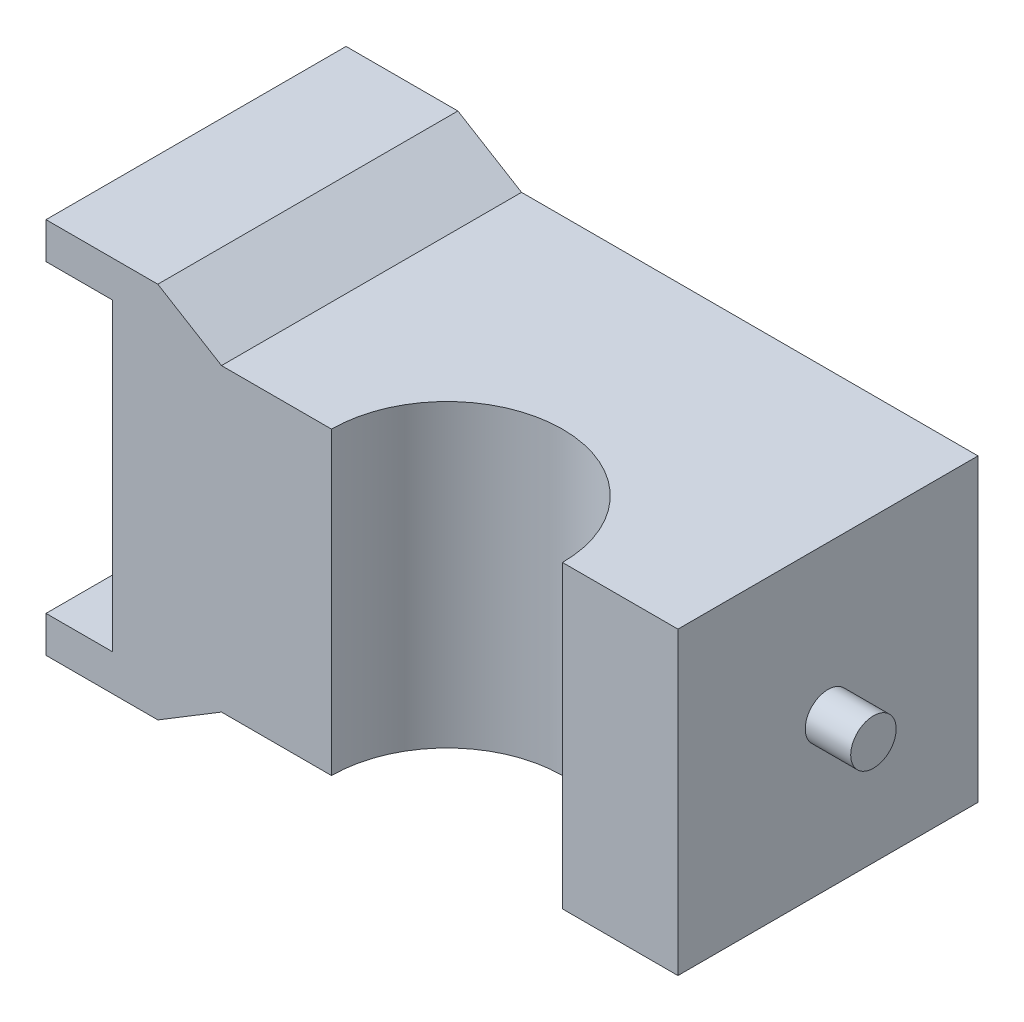
ISO-10303-21;
HEADER;
FILE_DESCRIPTION(('STEP AP214'),'2;1');
FILE_NAME('part.step','',(''),(''),'','','');
FILE_SCHEMA(('AUTOMOTIVE_DESIGN { 1 0 10303 214 1 1 1 1 }'));
ENDSEC;
DATA;
#1=APPLICATION_CONTEXT('core data for automotive mechanical design processes');
#2=APPLICATION_PROTOCOL_DEFINITION('international standard','automotive_design',2000,#1);
#3=PRODUCT_CONTEXT('',#1,'mechanical');
#4=PRODUCT('Part','Part','',(#3));
#5=PRODUCT_RELATED_PRODUCT_CATEGORY('part','',(#4));
#6=PRODUCT_DEFINITION_FORMATION('','',#4);
#7=PRODUCT_DEFINITION_CONTEXT('part definition',#1,'design');
#8=PRODUCT_DEFINITION('design','',#6,#7);
#9=PRODUCT_DEFINITION_SHAPE('','',#8);
#10=(LENGTH_UNIT() NAMED_UNIT(*) SI_UNIT(.MILLI.,.METRE.));
#11=(NAMED_UNIT(*) PLANE_ANGLE_UNIT() SI_UNIT($,.RADIAN.));
#12=(NAMED_UNIT(*) SI_UNIT($,.STERADIAN.) SOLID_ANGLE_UNIT());
#13=UNCERTAINTY_MEASURE_WITH_UNIT(LENGTH_MEASURE(1.E-05),#10,'distance_accuracy_value','');
#14=(GEOMETRIC_REPRESENTATION_CONTEXT(3) GLOBAL_UNCERTAINTY_ASSIGNED_CONTEXT((#13)) GLOBAL_UNIT_ASSIGNED_CONTEXT((#10,
#11,#12)) REPRESENTATION_CONTEXT('',''));
#15=CARTESIAN_POINT('',(0.,0.,0.));
#16=DIRECTION('',(0.,0.,1.));
#17=DIRECTION('',(1.,0.,0.));
#18=AXIS2_PLACEMENT_3D('',#15,#16,#17);
#19=CARTESIAN_POINT('',(0.,0.,16.5));
#20=DIRECTION('',(0.,0.,-1.));
#21=DIRECTION('',(-1.,0.,0.));
#22=AXIS2_PLACEMENT_3D('',#19,#20,#21);
#23=PLANE('',#22);
#24=DIRECTION('',(0.,-1.,0.));
#25=VECTOR('',#24,1.);
#26=CARTESIAN_POINT('',(12.4,20.75,16.5));
#27=LINE('',#26,#25);
#28=CARTESIAN_POINT('',(12.4,-16.5,16.5));
#29=VERTEX_POINT('',#28);
#30=CARTESIAN_POINT('',(12.4,16.5,16.5));
#31=VERTEX_POINT('',#30);
#32=EDGE_CURVE('E11',#29,#31,#27,.F.);
#33=ORIENTED_EDGE('',*,*,#32,.F.);
#34=DIRECTION('',(1.,0.,0.));
#35=VECTOR('',#34,1.);
#36=CARTESIAN_POINT('',(25.1,-16.5,16.5));
#37=LINE('',#36,#35);
#38=CARTESIAN_POINT('',(25.1,-16.5,16.5));
#39=VERTEX_POINT('',#38);
#40=EDGE_CURVE('E59',#29,#39,#37,.T.);
#41=ORIENTED_EDGE('',*,*,#40,.T.);
#42=DIRECTION('',(0.,1.,0.));
#43=VECTOR('',#42,1.);
#44=CARTESIAN_POINT('',(25.1,16.5,16.5));
#45=LINE('',#44,#43);
#46=CARTESIAN_POINT('',(25.1,16.5,16.5));
#47=VERTEX_POINT('',#46);
#48=EDGE_CURVE('E197',#39,#47,#45,.T.);
#49=ORIENTED_EDGE('',*,*,#48,.T.);
#50=DIRECTION('',(-1.,0.,0.));
#51=VECTOR('',#50,1.);
#52=CARTESIAN_POINT('',(25.1,16.5,16.5));
#53=LINE('',#52,#51);
#54=EDGE_CURVE('E113',#47,#31,#53,.T.);
#55=ORIENTED_EDGE('',*,*,#54,.T.);
#56=EDGE_LOOP('',(#33,#41,#49,#55));
#57=FACE_BOUND('',#56,.T.);
#58=ADVANCED_FACE('F36',(#57),#23,.F.);
#59=DIRECTION('',(0.,-1.,0.));
#60=VECTOR('',#59,1.);
#61=CARTESIAN_POINT('',(-13.,20.75,16.5));
#62=LINE('',#61,#60);
#63=CARTESIAN_POINT('',(-13.,16.5000000000001,16.5));
#64=VERTEX_POINT('',#63);
#65=CARTESIAN_POINT('',(-13.,-16.5,16.5));
#66=VERTEX_POINT('',#65);
#67=EDGE_CURVE('E44',#64,#66,#62,.T.);
#68=ORIENTED_EDGE('',*,*,#67,.F.);
#69=CARTESIAN_POINT('',(-25.1,16.5,16.5));
#70=VERTEX_POINT('',#69);
#71=EDGE_CURVE('E247',#64,#70,#53,.T.);
#72=ORIENTED_EDGE('',*,*,#71,.T.);
#73=DIRECTION('',(-0.854787515221729,0.518978134241763,0.));
#74=VECTOR('',#73,1.);
#75=CARTESIAN_POINT('',(-32.1,20.75,16.5));
#76=LINE('',#75,#74);
#77=CARTESIAN_POINT('',(-32.1,20.75,16.5));
#78=VERTEX_POINT('',#77);
#79=EDGE_CURVE('E249',#70,#78,#76,.T.);
#80=ORIENTED_EDGE('',*,*,#79,.T.);
#81=DIRECTION('',(-1.,0.,0.));
#82=VECTOR('',#81,1.);
#83=CARTESIAN_POINT('',(-44.4,20.75,16.5));
#84=LINE('',#83,#82);
#85=CARTESIAN_POINT('',(-44.4,20.75,16.5));
#86=VERTEX_POINT('',#85);
#87=EDGE_CURVE('E251',#78,#86,#84,.T.);
#88=ORIENTED_EDGE('',*,*,#87,.T.);
#89=DIRECTION('',(0.,-1.,0.));
#90=VECTOR('',#89,1.);
#91=CARTESIAN_POINT('',(-44.4,20.75,16.5));
#92=LINE('',#91,#90);
#93=CARTESIAN_POINT('',(-44.4,16.75,16.5));
#94=VERTEX_POINT('',#93);
#95=EDGE_CURVE('E253',#86,#94,#92,.T.);
#96=ORIENTED_EDGE('',*,*,#95,.T.);
#97=DIRECTION('',(1.,0.,0.));
#98=VECTOR('',#97,1.);
#99=CARTESIAN_POINT('',(-44.4,16.75,16.5));
#100=LINE('',#99,#98);
#101=CARTESIAN_POINT('',(-37.1,16.75,16.5));
#102=VERTEX_POINT('',#101);
#103=EDGE_CURVE('E255',#94,#102,#100,.T.);
#104=ORIENTED_EDGE('',*,*,#103,.T.);
#105=DIRECTION('',(0.,-1.,0.));
#106=VECTOR('',#105,1.);
#107=CARTESIAN_POINT('',(-37.1,16.75,16.5));
#108=LINE('',#107,#106);
#109=CARTESIAN_POINT('',(-37.1,-16.75,16.5));
#110=VERTEX_POINT('',#109);
#111=EDGE_CURVE('E257',#102,#110,#108,.T.);
#112=ORIENTED_EDGE('',*,*,#111,.T.);
#113=DIRECTION('',(-1.,0.,0.));
#114=VECTOR('',#113,1.);
#115=CARTESIAN_POINT('',(-44.4,-16.75,16.5));
#116=LINE('',#115,#114);
#117=CARTESIAN_POINT('',(-44.4,-16.75,16.5));
#118=VERTEX_POINT('',#117);
#119=EDGE_CURVE('E259',#110,#118,#116,.T.);
#120=ORIENTED_EDGE('',*,*,#119,.T.);
#121=DIRECTION('',(0.,-1.,0.));
#122=VECTOR('',#121,1.);
#123=CARTESIAN_POINT('',(-44.4,-20.75,16.5));
#124=LINE('',#123,#122);
#125=CARTESIAN_POINT('',(-44.4,-20.75,16.5));
#126=VERTEX_POINT('',#125);
#127=EDGE_CURVE('E150',#118,#126,#124,.T.);
#128=ORIENTED_EDGE('',*,*,#127,.T.);
#129=DIRECTION('',(1.,0.,0.));
#130=VECTOR('',#129,1.);
#131=CARTESIAN_POINT('',(-44.4,-20.75,16.5));
#132=LINE('',#131,#130);
#133=CARTESIAN_POINT('',(-32.1,-20.75,16.5));
#134=VERTEX_POINT('',#133);
#135=EDGE_CURVE('E142',#126,#134,#132,.T.);
#136=ORIENTED_EDGE('',*,*,#135,.T.);
#137=DIRECTION('',(0.85478751522173,0.518978134241763,0.));
#138=VECTOR('',#137,1.);
#139=CARTESIAN_POINT('',(-32.1,-20.75,16.5));
#140=LINE('',#139,#138);
#141=CARTESIAN_POINT('',(-25.1,-16.5,16.5));
#142=VERTEX_POINT('',#141);
#143=EDGE_CURVE('E147',#134,#142,#140,.T.);
#144=ORIENTED_EDGE('',*,*,#143,.T.);
#145=EDGE_CURVE('E168',#142,#66,#37,.T.);
#146=ORIENTED_EDGE('',*,*,#145,.T.);
#147=EDGE_LOOP('',(#68,#72,#80,#88,#96,#104,#112,#120,#128,#136,#144,#146));
#148=FACE_BOUND('',#147,.T.);
#149=ADVANCED_FACE('F144',(#148),#23,.F.);
#150=CARTESIAN_POINT('',(25.1,16.5,16.5));
#151=DIRECTION('',(-1.,0.,0.));
#152=DIRECTION('',(0.,-1.,0.));
#153=AXIS2_PLACEMENT_3D('',#150,#151,#152);
#154=PLANE('',#153);
#155=DIRECTION('',(0.,1.,0.));
#156=VECTOR('',#155,1.);
#157=CARTESIAN_POINT('',(25.1,16.5,-16.5));
#158=LINE('',#157,#156);
#159=CARTESIAN_POINT('',(25.1,-16.5,-16.5));
#160=VERTEX_POINT('',#159);
#161=CARTESIAN_POINT('',(25.1,16.5,-16.5));
#162=VERTEX_POINT('',#161);
#163=EDGE_CURVE('E173',#160,#162,#158,.T.);
#164=ORIENTED_EDGE('',*,*,#163,.T.);
#165=DIRECTION('',(0.,0.,-1.));
#166=VECTOR('',#165,1.);
#167=CARTESIAN_POINT('',(25.1,16.5,16.5));
#168=LINE('',#167,#166);
#169=EDGE_CURVE('E222',#47,#162,#168,.T.);
#170=ORIENTED_EDGE('',*,*,#169,.F.);
#171=ORIENTED_EDGE('',*,*,#48,.F.);
#172=DIRECTION('',(0.,0.,-1.));
#173=VECTOR('',#172,1.);
#174=CARTESIAN_POINT('',(25.1,-16.5,16.5));
#175=LINE('',#174,#173);
#176=EDGE_CURVE('E172',#39,#160,#175,.T.);
#177=ORIENTED_EDGE('',*,*,#176,.T.);
#178=EDGE_LOOP('',(#164,#170,#171,#177));
#179=FACE_BOUND('',#178,.T.);
#180=CARTESIAN_POINT('',(25.1,0.,0.));
#181=DIRECTION('',(-1.,0.,0.));
#182=DIRECTION('',(0.,-1.,0.));
#183=AXIS2_PLACEMENT_3D('',#180,#181,#182);
#184=CIRCLE('',#183,2.5);
#185=CARTESIAN_POINT('',(25.1,-2.50000000000001,0.));
#186=VERTEX_POINT('',#185);
#187=EDGE_CURVE('E227',#186,#186,#184,.F.);
#188=ORIENTED_EDGE('',*,*,#187,.F.);
#189=EDGE_LOOP('',(#188));
#190=FACE_BOUND('',#189,.T.);
#191=ADVANCED_FACE('F38',(#179,#190),#154,.F.);
#192=CARTESIAN_POINT('',(-37.1,16.75,16.5));
#193=DIRECTION('',(1.,0.,0.));
#194=DIRECTION('',(0.,1.,0.));
#195=AXIS2_PLACEMENT_3D('',#192,#193,#194);
#196=PLANE('',#195);
#197=DIRECTION('',(0.,-1.,0.));
#198=VECTOR('',#197,1.);
#199=CARTESIAN_POINT('',(-37.1,16.75,-16.5));
#200=LINE('',#199,#198);
#201=CARTESIAN_POINT('',(-37.1,16.75,-16.5));
#202=VERTEX_POINT('',#201);
#203=CARTESIAN_POINT('',(-37.1,-16.75,-16.5));
#204=VERTEX_POINT('',#203);
#205=EDGE_CURVE('E187',#202,#204,#200,.T.);
#206=ORIENTED_EDGE('',*,*,#205,.T.);
#207=DIRECTION('',(0.,0.,-1.));
#208=VECTOR('',#207,1.);
#209=CARTESIAN_POINT('',(-37.1,-16.75,16.5));
#210=LINE('',#209,#208);
#211=EDGE_CURVE('E204',#110,#204,#210,.T.);
#212=ORIENTED_EDGE('',*,*,#211,.F.);
#213=ORIENTED_EDGE('',*,*,#111,.F.);
#214=DIRECTION('',(0.,0.,-1.));
#215=VECTOR('',#214,1.);
#216=CARTESIAN_POINT('',(-37.1,16.75,16.5));
#217=LINE('',#216,#215);
#218=EDGE_CURVE('E207',#102,#202,#217,.T.);
#219=ORIENTED_EDGE('',*,*,#218,.T.);
#220=EDGE_LOOP('',(#206,#212,#213,#219));
#221=FACE_BOUND('',#220,.T.);
#222=CARTESIAN_POINT('',(-37.1,0.,0.));
#223=DIRECTION('',(1.,0.,0.));
#224=DIRECTION('',(0.,1.,0.));
#225=AXIS2_PLACEMENT_3D('',#222,#223,#224);
#226=CIRCLE('',#225,2.5);
#227=CARTESIAN_POINT('',(-37.1,2.49999999999999,0.));
#228=VERTEX_POINT('',#227);
#229=EDGE_CURVE('E224',#228,#228,#226,.F.);
#230=ORIENTED_EDGE('',*,*,#229,.F.);
#231=EDGE_LOOP('',(#230));
#232=FACE_BOUND('',#231,.T.);
#233=ADVANCED_FACE('F301',(#221,#232),#196,.F.);
#234=CARTESIAN_POINT('',(25.1,16.5,16.5));
#235=DIRECTION('',(0.,-1.,0.));
#236=DIRECTION('',(1.,0.,0.));
#237=AXIS2_PLACEMENT_3D('',#234,#235,#236);
#238=PLANE('',#237);
#239=CARTESIAN_POINT('',(-0.299999999999998,16.5,16.5));
#240=DIRECTION('',(0.,-1.,0.));
#241=DIRECTION('',(1.,0.,0.));
#242=AXIS2_PLACEMENT_3D('',#239,#240,#241);
#243=CIRCLE('',#242,12.7);
#244=EDGE_CURVE('E50',#31,#64,#243,.F.);
#245=ORIENTED_EDGE('',*,*,#244,.F.);
#246=ORIENTED_EDGE('',*,*,#54,.F.);
#247=ORIENTED_EDGE('',*,*,#169,.T.);
#248=DIRECTION('',(-1.,0.,0.));
#249=VECTOR('',#248,1.);
#250=CARTESIAN_POINT('',(25.1,16.5,-16.5));
#251=LINE('',#250,#249);
#252=CARTESIAN_POINT('',(-25.1,16.5,-16.5));
#253=VERTEX_POINT('',#252);
#254=EDGE_CURVE('E176',#162,#253,#251,.T.);
#255=ORIENTED_EDGE('',*,*,#254,.T.);
#256=DIRECTION('',(0.,0.,-1.));
#257=VECTOR('',#256,1.);
#258=CARTESIAN_POINT('',(-25.1,16.5,16.5));
#259=LINE('',#258,#257);
#260=EDGE_CURVE('E219',#70,#253,#259,.T.);
#261=ORIENTED_EDGE('',*,*,#260,.F.);
#262=ORIENTED_EDGE('',*,*,#71,.F.);
#263=EDGE_LOOP('',(#245,#246,#247,#255,#261,#262));
#264=FACE_BOUND('',#263,.T.);
#265=ADVANCED_FACE('F278',(#264),#238,.F.);
#266=CARTESIAN_POINT('',(-32.1,20.75,16.5));
#267=DIRECTION('',(-0.518978134241763,-0.854787515221729,0.));
#268=DIRECTION('',(0.85478751522173,-0.518978134241763,0.));
#269=AXIS2_PLACEMENT_3D('',#266,#267,#268);
#270=PLANE('',#269);
#271=DIRECTION('',(-0.854787515221729,0.518978134241763,0.));
#272=VECTOR('',#271,1.);
#273=CARTESIAN_POINT('',(-32.1,20.75,-16.5));
#274=LINE('',#273,#272);
#275=CARTESIAN_POINT('',(-32.1,20.75,-16.5));
#276=VERTEX_POINT('',#275);
#277=EDGE_CURVE('E179',#253,#276,#274,.T.);
#278=ORIENTED_EDGE('',*,*,#277,.T.);
#279=DIRECTION('',(0.,0.,-1.));
#280=VECTOR('',#279,1.);
#281=CARTESIAN_POINT('',(-32.1,20.75,16.5));
#282=LINE('',#281,#280);
#283=EDGE_CURVE('E216',#78,#276,#282,.T.);
#284=ORIENTED_EDGE('',*,*,#283,.F.);
#285=ORIENTED_EDGE('',*,*,#79,.F.);
#286=ORIENTED_EDGE('',*,*,#260,.T.);
#287=EDGE_LOOP('',(#278,#284,#285,#286));
#288=FACE_BOUND('',#287,.T.);
#289=ADVANCED_FACE('F285',(#288),#270,.F.);
#290=CARTESIAN_POINT('',(-44.4,20.75,16.5));
#291=DIRECTION('',(0.,-1.,0.));
#292=DIRECTION('',(1.,0.,0.));
#293=AXIS2_PLACEMENT_3D('',#290,#291,#292);
#294=PLANE('',#293);
#295=DIRECTION('',(-1.,0.,0.));
#296=VECTOR('',#295,1.);
#297=CARTESIAN_POINT('',(-44.4,20.75,-16.5));
#298=LINE('',#297,#296);
#299=CARTESIAN_POINT('',(-44.4,20.75,-16.5));
#300=VERTEX_POINT('',#299);
#301=EDGE_CURVE('E181',#276,#300,#298,.T.);
#302=ORIENTED_EDGE('',*,*,#301,.T.);
#303=DIRECTION('',(0.,0.,-1.));
#304=VECTOR('',#303,1.);
#305=CARTESIAN_POINT('',(-44.4,20.75,16.5));
#306=LINE('',#305,#304);
#307=EDGE_CURVE('E213',#86,#300,#306,.T.);
#308=ORIENTED_EDGE('',*,*,#307,.F.);
#309=ORIENTED_EDGE('',*,*,#87,.F.);
#310=ORIENTED_EDGE('',*,*,#283,.T.);
#311=EDGE_LOOP('',(#302,#308,#309,#310));
#312=FACE_BOUND('',#311,.T.);
#313=ADVANCED_FACE('F288',(#312),#294,.F.);
#314=CARTESIAN_POINT('',(-44.4,20.75,16.5));
#315=DIRECTION('',(1.,0.,0.));
#316=DIRECTION('',(0.,1.,0.));
#317=AXIS2_PLACEMENT_3D('',#314,#315,#316);
#318=PLANE('',#317);
#319=DIRECTION('',(0.,-1.,0.));
#320=VECTOR('',#319,1.);
#321=CARTESIAN_POINT('',(-44.4,20.75,-16.5));
#322=LINE('',#321,#320);
#323=CARTESIAN_POINT('',(-44.4,16.75,-16.5));
#324=VERTEX_POINT('',#323);
#325=EDGE_CURVE('E183',#300,#324,#322,.T.);
#326=ORIENTED_EDGE('',*,*,#325,.T.);
#327=DIRECTION('',(0.,0.,-1.));
#328=VECTOR('',#327,1.);
#329=CARTESIAN_POINT('',(-44.4,16.75,16.5));
#330=LINE('',#329,#328);
#331=EDGE_CURVE('E210',#94,#324,#330,.T.);
#332=ORIENTED_EDGE('',*,*,#331,.F.);
#333=ORIENTED_EDGE('',*,*,#95,.F.);
#334=ORIENTED_EDGE('',*,*,#307,.T.);
#335=EDGE_LOOP('',(#326,#332,#333,#334));
#336=FACE_BOUND('',#335,.T.);
#337=ADVANCED_FACE('F293',(#336),#318,.F.);
#338=CARTESIAN_POINT('',(-44.4,16.75,16.5));
#339=DIRECTION('',(0.,1.,0.));
#340=DIRECTION('',(-1.,0.,0.));
#341=AXIS2_PLACEMENT_3D('',#338,#339,#340);
#342=PLANE('',#341);
#343=DIRECTION('',(1.,0.,0.));
#344=VECTOR('',#343,1.);
#345=CARTESIAN_POINT('',(-44.4,16.75,-16.5));
#346=LINE('',#345,#344);
#347=EDGE_CURVE('E185',#324,#202,#346,.T.);
#348=ORIENTED_EDGE('',*,*,#347,.T.);
#349=ORIENTED_EDGE('',*,*,#218,.F.);
#350=ORIENTED_EDGE('',*,*,#103,.F.);
#351=ORIENTED_EDGE('',*,*,#331,.T.);
#352=EDGE_LOOP('',(#348,#349,#350,#351));
#353=FACE_BOUND('',#352,.T.);
#354=ADVANCED_FACE('F297',(#353),#342,.F.);
#355=CARTESIAN_POINT('',(-44.4,-16.75,16.5));
#356=DIRECTION('',(0.,-1.,0.));
#357=DIRECTION('',(1.,0.,0.));
#358=AXIS2_PLACEMENT_3D('',#355,#356,#357);
#359=PLANE('',#358);
#360=DIRECTION('',(-1.,0.,0.));
#361=VECTOR('',#360,1.);
#362=CARTESIAN_POINT('',(-44.4,-16.75,-16.5));
#363=LINE('',#362,#361);
#364=CARTESIAN_POINT('',(-44.4,-16.75,-16.5));
#365=VERTEX_POINT('',#364);
#366=EDGE_CURVE('E189',#204,#365,#363,.T.);
#367=ORIENTED_EDGE('',*,*,#366,.T.);
#368=DIRECTION('',(0.,0.,-1.));
#369=VECTOR('',#368,1.);
#370=CARTESIAN_POINT('',(-44.4,-16.75,16.5));
#371=LINE('',#370,#369);
#372=EDGE_CURVE('E201',#118,#365,#371,.T.);
#373=ORIENTED_EDGE('',*,*,#372,.F.);
#374=ORIENTED_EDGE('',*,*,#119,.F.);
#375=ORIENTED_EDGE('',*,*,#211,.T.);
#376=EDGE_LOOP('',(#367,#373,#374,#375));
#377=FACE_BOUND('',#376,.T.);
#378=ADVANCED_FACE('F265',(#377),#359,.F.);
#379=CARTESIAN_POINT('',(-44.4,-20.75,16.5));
#380=DIRECTION('',(1.,0.,0.));
#381=DIRECTION('',(0.,1.,0.));
#382=AXIS2_PLACEMENT_3D('',#379,#380,#381);
#383=PLANE('',#382);
#384=DIRECTION('',(0.,-1.,0.));
#385=VECTOR('',#384,1.);
#386=CARTESIAN_POINT('',(-44.4,-20.75,-16.5));
#387=LINE('',#386,#385);
#388=CARTESIAN_POINT('',(-44.4,-20.75,-16.5));
#389=VERTEX_POINT('',#388);
#390=EDGE_CURVE('E191',#365,#389,#387,.T.);
#391=ORIENTED_EDGE('',*,*,#390,.T.);
#392=DIRECTION('',(0.,0.,-1.));
#393=VECTOR('',#392,1.);
#394=CARTESIAN_POINT('',(-44.4,-20.75,16.5));
#395=LINE('',#394,#393);
#396=EDGE_CURVE('E162',#126,#389,#395,.T.);
#397=ORIENTED_EDGE('',*,*,#396,.F.);
#398=ORIENTED_EDGE('',*,*,#127,.F.);
#399=ORIENTED_EDGE('',*,*,#372,.T.);
#400=EDGE_LOOP('',(#391,#397,#398,#399));
#401=FACE_BOUND('',#400,.T.);
#402=ADVANCED_FACE('F269',(#401),#383,.F.);
#403=CARTESIAN_POINT('',(-44.4,-20.75,16.5));
#404=DIRECTION('',(0.,1.,0.));
#405=DIRECTION('',(-1.,0.,0.));
#406=AXIS2_PLACEMENT_3D('',#403,#404,#405);
#407=PLANE('',#406);
#408=DIRECTION('',(1.,0.,0.));
#409=VECTOR('',#408,1.);
#410=CARTESIAN_POINT('',(-44.4,-20.75,-16.5));
#411=LINE('',#410,#409);
#412=CARTESIAN_POINT('',(-32.1,-20.75,-16.5));
#413=VERTEX_POINT('',#412);
#414=EDGE_CURVE('E159',#389,#413,#411,.T.);
#415=ORIENTED_EDGE('',*,*,#414,.T.);
#416=DIRECTION('',(0.,0.,-1.));
#417=VECTOR('',#416,1.);
#418=CARTESIAN_POINT('',(-32.1,-20.75,16.5));
#419=LINE('',#418,#417);
#420=EDGE_CURVE('E156',#134,#413,#419,.T.);
#421=ORIENTED_EDGE('',*,*,#420,.F.);
#422=ORIENTED_EDGE('',*,*,#135,.F.);
#423=ORIENTED_EDGE('',*,*,#396,.T.);
#424=EDGE_LOOP('',(#415,#421,#422,#423));
#425=FACE_BOUND('',#424,.T.);
#426=ADVANCED_FACE('F157',(#425),#407,.F.);
#427=CARTESIAN_POINT('',(-32.1,-20.75,16.5));
#428=DIRECTION('',(-0.518978134241763,0.854787515221729,0.));
#429=DIRECTION('',(-0.85478751522173,-0.518978134241763,0.));
#430=AXIS2_PLACEMENT_3D('',#427,#428,#429);
#431=PLANE('',#430);
#432=DIRECTION('',(0.85478751522173,0.518978134241763,0.));
#433=VECTOR('',#432,1.);
#434=CARTESIAN_POINT('',(-32.1,-20.75,-16.5));
#435=LINE('',#434,#433);
#436=CARTESIAN_POINT('',(-25.1,-16.5,-16.5));
#437=VERTEX_POINT('',#436);
#438=EDGE_CURVE('E194',#413,#437,#435,.T.);
#439=ORIENTED_EDGE('',*,*,#438,.T.);
#440=DIRECTION('',(0.,0.,-1.));
#441=VECTOR('',#440,1.);
#442=CARTESIAN_POINT('',(-25.1,-16.5,16.5));
#443=LINE('',#442,#441);
#444=EDGE_CURVE('E163',#142,#437,#443,.T.);
#445=ORIENTED_EDGE('',*,*,#444,.F.);
#446=ORIENTED_EDGE('',*,*,#143,.F.);
#447=ORIENTED_EDGE('',*,*,#420,.T.);
#448=EDGE_LOOP('',(#439,#445,#446,#447));
#449=FACE_BOUND('',#448,.T.);
#450=ADVANCED_FACE('F165',(#449),#431,.F.);
#451=CARTESIAN_POINT('',(25.1,-16.5,16.5));
#452=DIRECTION('',(0.,1.,0.));
#453=DIRECTION('',(0.,0.,1.));
#454=AXIS2_PLACEMENT_3D('',#451,#452,#453);
#455=PLANE('',#454);
#456=CARTESIAN_POINT('',(-0.299999999999998,-16.5,16.5));
#457=DIRECTION('',(0.,1.,0.));
#458=DIRECTION('',(0.,0.,1.));
#459=AXIS2_PLACEMENT_3D('',#456,#457,#458);
#460=CIRCLE('',#459,12.7);
#461=EDGE_CURVE('E234',#66,#29,#460,.F.);
#462=ORIENTED_EDGE('',*,*,#461,.F.);
#463=ORIENTED_EDGE('',*,*,#145,.F.);
#464=ORIENTED_EDGE('',*,*,#444,.T.);
#465=DIRECTION('',(1.,0.,0.));
#466=VECTOR('',#465,1.);
#467=CARTESIAN_POINT('',(25.1,-16.5,-16.5));
#468=LINE('',#467,#466);
#469=EDGE_CURVE('E105',#437,#160,#468,.T.);
#470=ORIENTED_EDGE('',*,*,#469,.T.);
#471=ORIENTED_EDGE('',*,*,#176,.F.);
#472=ORIENTED_EDGE('',*,*,#40,.F.);
#473=EDGE_LOOP('',(#462,#463,#464,#470,#471,#472));
#474=FACE_BOUND('',#473,.T.);
#475=ADVANCED_FACE('F237',(#474),#455,.F.);
#476=CARTESIAN_POINT('',(0.,0.,-16.5));
#477=DIRECTION('',(0.,0.,-1.));
#478=DIRECTION('',(-1.,0.,0.));
#479=AXIS2_PLACEMENT_3D('',#476,#477,#478);
#480=PLANE('',#479);
#481=ORIENTED_EDGE('',*,*,#163,.F.);
#482=ORIENTED_EDGE('',*,*,#469,.F.);
#483=ORIENTED_EDGE('',*,*,#438,.F.);
#484=ORIENTED_EDGE('',*,*,#414,.F.);
#485=ORIENTED_EDGE('',*,*,#390,.F.);
#486=ORIENTED_EDGE('',*,*,#366,.F.);
#487=ORIENTED_EDGE('',*,*,#205,.F.);
#488=ORIENTED_EDGE('',*,*,#347,.F.);
#489=ORIENTED_EDGE('',*,*,#325,.F.);
#490=ORIENTED_EDGE('',*,*,#301,.F.);
#491=ORIENTED_EDGE('',*,*,#277,.F.);
#492=ORIENTED_EDGE('',*,*,#254,.F.);
#493=EDGE_LOOP('',(#481,#482,#483,#484,#485,#486,#487,#488,#489,#490,#491,#492));
#494=FACE_BOUND('',#493,.T.);
#495=ADVANCED_FACE('F272',(#494),#480,.T.);
#496=CARTESIAN_POINT('',(-42.1,0.,0.));
#497=DIRECTION('',(1.,0.,0.));
#498=DIRECTION('',(0.,0.,-1.));
#499=AXIS2_PLACEMENT_3D('',#496,#497,#498);
#500=CYLINDRICAL_SURFACE('',#499,2.5);
#501=CARTESIAN_POINT('',(-42.1,0.,0.));
#502=DIRECTION('',(-1.,0.,0.));
#503=DIRECTION('',(0.,0.,1.));
#504=AXIS2_PLACEMENT_3D('',#501,#502,#503);
#505=CIRCLE('',#504,2.5);
#506=CARTESIAN_POINT('',(-42.1,0.,2.5));
#507=VERTEX_POINT('',#506);
#508=EDGE_CURVE('E177',#507,#507,#505,.T.);
#509=ORIENTED_EDGE('',*,*,#508,.F.);
#510=EDGE_LOOP('',(#509));
#511=FACE_BOUND('',#510,.T.);
#512=ORIENTED_EDGE('',*,*,#229,.T.);
#513=EDGE_LOOP('',(#512));
#514=FACE_BOUND('',#513,.T.);
#515=ADVANCED_FACE('F307',(#511,#514),#500,.T.);
#516=CARTESIAN_POINT('',(-42.1,0.,0.));
#517=DIRECTION('',(-1.,0.,0.));
#518=DIRECTION('',(0.,0.,1.));
#519=AXIS2_PLACEMENT_3D('',#516,#517,#518);
#520=PLANE('',#519);
#521=ORIENTED_EDGE('',*,*,#508,.T.);
#522=EDGE_LOOP('',(#521));
#523=FACE_BOUND('',#522,.T.);
#524=ADVANCED_FACE('F309',(#523),#520,.T.);
#525=CARTESIAN_POINT('',(30.1,0.,0.));
#526=DIRECTION('',(-1.,0.,0.));
#527=DIRECTION('',(0.,-1.,0.));
#528=AXIS2_PLACEMENT_3D('',#525,#526,#527);
#529=CYLINDRICAL_SURFACE('',#528,2.5);
#530=CARTESIAN_POINT('',(30.1,0.,0.));
#531=DIRECTION('',(1.,0.,0.));
#532=DIRECTION('',(0.,1.,0.));
#533=AXIS2_PLACEMENT_3D('',#530,#531,#532);
#534=CIRCLE('',#533,2.5);
#535=CARTESIAN_POINT('',(30.1,2.49999999999999,0.));
#536=VERTEX_POINT('',#535);
#537=EDGE_CURVE('E239',#536,#536,#534,.T.);
#538=ORIENTED_EDGE('',*,*,#537,.F.);
#539=EDGE_LOOP('',(#538));
#540=FACE_BOUND('',#539,.T.);
#541=ORIENTED_EDGE('',*,*,#187,.T.);
#542=EDGE_LOOP('',(#541));
#543=FACE_BOUND('',#542,.T.);
#544=ADVANCED_FACE('F316',(#540,#543),#529,.T.);
#545=CARTESIAN_POINT('',(30.1,0.,0.));
#546=DIRECTION('',(1.,0.,0.));
#547=DIRECTION('',(0.,1.,0.));
#548=AXIS2_PLACEMENT_3D('',#545,#546,#547);
#549=PLANE('',#548);
#550=ORIENTED_EDGE('',*,*,#537,.T.);
#551=EDGE_LOOP('',(#550));
#552=FACE_BOUND('',#551,.T.);
#553=ADVANCED_FACE('F412',(#552),#549,.T.);
#554=CARTESIAN_POINT('',(-0.299999999999998,20.75,16.5));
#555=DIRECTION('',(0.,-1.,0.));
#556=DIRECTION('',(0.,0.,-1.));
#557=AXIS2_PLACEMENT_3D('',#554,#555,#556);
#558=CYLINDRICAL_SURFACE('',#557,12.7);
#559=ORIENTED_EDGE('',*,*,#32,.T.);
#560=ORIENTED_EDGE('',*,*,#244,.T.);
#561=ORIENTED_EDGE('',*,*,#67,.T.);
#562=ORIENTED_EDGE('',*,*,#461,.T.);
#563=EDGE_LOOP('',(#559,#560,#561,#562));
#564=FACE_BOUND('',#563,.T.);
#565=ADVANCED_FACE('F232',(#564),#558,.F.);
#566=CLOSED_SHELL('',(#58,#149,#191,#233,#265,#289,#313,#337,#354,#378,#402,#426,#450,#475,#495,
#515,#524,#544,#553,#565));
#567=MANIFOLD_SOLID_BREP('B2',#566);
#568=ADVANCED_BREP_SHAPE_REPRESENTATION('',(#18,#567),#14);
#569=SHAPE_DEFINITION_REPRESENTATION(#9,#568);
ENDSEC;
END-ISO-10303-21;
